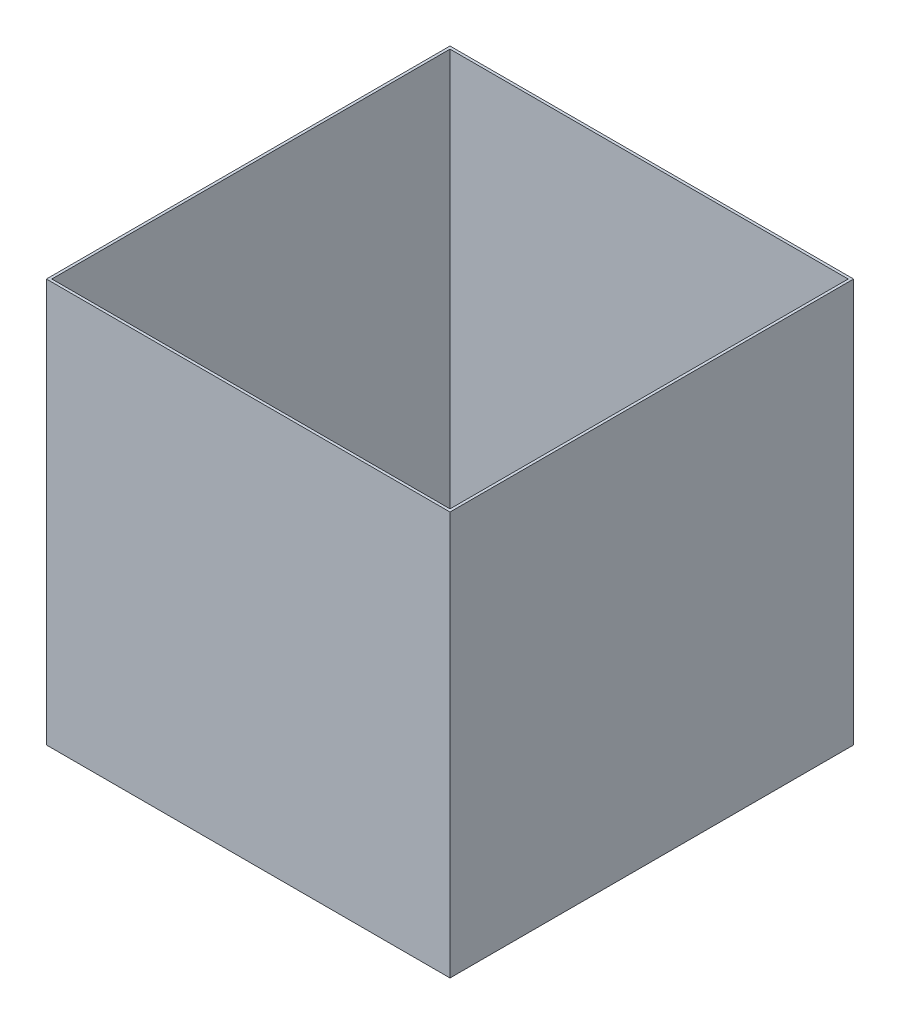
ISO-10303-21;
HEADER;
FILE_DESCRIPTION(('STEP AP214'),'2;1');
FILE_NAME('part.step','',(''),(''),'','','');
FILE_SCHEMA(('AUTOMOTIVE_DESIGN { 1 0 10303 214 1 1 1 1 }'));
ENDSEC;
DATA;
#1=APPLICATION_CONTEXT('core data for automotive mechanical design processes');
#2=APPLICATION_PROTOCOL_DEFINITION('international standard','automotive_design',2000,#1);
#3=PRODUCT_CONTEXT('',#1,'mechanical');
#4=PRODUCT('Part','Part','',(#3));
#5=PRODUCT_RELATED_PRODUCT_CATEGORY('part','',(#4));
#6=PRODUCT_DEFINITION_FORMATION('','',#4);
#7=PRODUCT_DEFINITION_CONTEXT('part definition',#1,'design');
#8=PRODUCT_DEFINITION('design','',#6,#7);
#9=PRODUCT_DEFINITION_SHAPE('','',#8);
#10=(LENGTH_UNIT() NAMED_UNIT(*) SI_UNIT(.MILLI.,.METRE.));
#11=(NAMED_UNIT(*) PLANE_ANGLE_UNIT() SI_UNIT($,.RADIAN.));
#12=(NAMED_UNIT(*) SI_UNIT($,.STERADIAN.) SOLID_ANGLE_UNIT());
#13=UNCERTAINTY_MEASURE_WITH_UNIT(LENGTH_MEASURE(1.E-05),#10,'distance_accuracy_value','');
#14=(GEOMETRIC_REPRESENTATION_CONTEXT(3) GLOBAL_UNCERTAINTY_ASSIGNED_CONTEXT((#13)) GLOBAL_UNIT_ASSIGNED_CONTEXT((#10,
#11,#12)) REPRESENTATION_CONTEXT('',''));
#15=CARTESIAN_POINT('',(0.,0.,0.));
#16=DIRECTION('',(0.,0.,1.));
#17=DIRECTION('',(1.,0.,0.));
#18=AXIS2_PLACEMENT_3D('',#15,#16,#17);
#19=CARTESIAN_POINT('',(150.,300.,-150.));
#20=DIRECTION('',(-1.,0.,0.));
#21=DIRECTION('',(0.,0.,1.));
#22=AXIS2_PLACEMENT_3D('',#19,#20,#21);
#23=PLANE('',#22);
#24=DIRECTION('',(0.,0.,-1.));
#25=VECTOR('',#24,1.);
#26=CARTESIAN_POINT('',(150.,0.,-150.));
#27=LINE('',#26,#25);
#28=CARTESIAN_POINT('',(150.,0.,150.));
#29=VERTEX_POINT('',#28);
#30=CARTESIAN_POINT('',(150.,0.,-150.));
#31=VERTEX_POINT('',#30);
#32=EDGE_CURVE('E147',#29,#31,#27,.T.);
#33=ORIENTED_EDGE('',*,*,#32,.T.);
#34=DIRECTION('',(0.,-1.,0.));
#35=VECTOR('',#34,1.);
#36=CARTESIAN_POINT('',(150.,300.,-150.));
#37=LINE('',#36,#35);
#38=CARTESIAN_POINT('',(150.,300.,-150.));
#39=VERTEX_POINT('',#38);
#40=EDGE_CURVE('E11',#39,#31,#37,.T.);
#41=ORIENTED_EDGE('',*,*,#40,.F.);
#42=DIRECTION('',(0.,0.,-1.));
#43=VECTOR('',#42,1.);
#44=CARTESIAN_POINT('',(150.,300.,-150.));
#45=LINE('',#44,#43);
#46=CARTESIAN_POINT('',(150.,300.,150.));
#47=VERTEX_POINT('',#46);
#48=EDGE_CURVE('E140',#47,#39,#45,.T.);
#49=ORIENTED_EDGE('',*,*,#48,.F.);
#50=DIRECTION('',(0.,-1.,0.));
#51=VECTOR('',#50,1.);
#52=CARTESIAN_POINT('',(150.,300.,150.));
#53=LINE('',#52,#51);
#54=EDGE_CURVE('E146',#47,#29,#53,.T.);
#55=ORIENTED_EDGE('',*,*,#54,.T.);
#56=EDGE_LOOP('',(#33,#41,#49,#55));
#57=FACE_BOUND('',#56,.T.);
#58=ADVANCED_FACE('F33',(#57),#23,.F.);
#59=CARTESIAN_POINT('',(-150.,300.,-150.));
#60=DIRECTION('',(0.,0.,1.));
#61=DIRECTION('',(1.,0.,0.));
#62=AXIS2_PLACEMENT_3D('',#59,#60,#61);
#63=PLANE('',#62);
#64=DIRECTION('',(-1.,0.,0.));
#65=VECTOR('',#64,1.);
#66=CARTESIAN_POINT('',(-150.,0.,-150.));
#67=LINE('',#66,#65);
#68=CARTESIAN_POINT('',(-150.,0.,-150.));
#69=VERTEX_POINT('',#68);
#70=EDGE_CURVE('E150',#31,#69,#67,.T.);
#71=ORIENTED_EDGE('',*,*,#70,.T.);
#72=DIRECTION('',(0.,-1.,0.));
#73=VECTOR('',#72,1.);
#74=CARTESIAN_POINT('',(-150.,300.,-150.));
#75=LINE('',#74,#73);
#76=CARTESIAN_POINT('',(-150.,300.,-150.));
#77=VERTEX_POINT('',#76);
#78=EDGE_CURVE('E40',#77,#69,#75,.T.);
#79=ORIENTED_EDGE('',*,*,#78,.F.);
#80=DIRECTION('',(-1.,0.,0.));
#81=VECTOR('',#80,1.);
#82=CARTESIAN_POINT('',(-150.,300.,-150.));
#83=LINE('',#82,#81);
#84=EDGE_CURVE('E84',#39,#77,#83,.T.);
#85=ORIENTED_EDGE('',*,*,#84,.F.);
#86=ORIENTED_EDGE('',*,*,#40,.T.);
#87=EDGE_LOOP('',(#71,#79,#85,#86));
#88=FACE_BOUND('',#87,.T.);
#89=ADVANCED_FACE('F179',(#88),#63,.F.);
#90=CARTESIAN_POINT('',(-150.,300.,-150.));
#91=DIRECTION('',(1.,0.,0.));
#92=DIRECTION('',(0.,0.,-1.));
#93=AXIS2_PLACEMENT_3D('',#90,#91,#92);
#94=PLANE('',#93);
#95=DIRECTION('',(0.,0.,1.));
#96=VECTOR('',#95,1.);
#97=CARTESIAN_POINT('',(-150.,0.,-150.));
#98=LINE('',#97,#96);
#99=CARTESIAN_POINT('',(-150.,0.,150.));
#100=VERTEX_POINT('',#99);
#101=EDGE_CURVE('E152',#69,#100,#98,.T.);
#102=ORIENTED_EDGE('',*,*,#101,.T.);
#103=DIRECTION('',(0.,-1.,0.));
#104=VECTOR('',#103,1.);
#105=CARTESIAN_POINT('',(-150.,300.,150.));
#106=LINE('',#105,#104);
#107=CARTESIAN_POINT('',(-150.,300.,150.));
#108=VERTEX_POINT('',#107);
#109=EDGE_CURVE('E156',#108,#100,#106,.T.);
#110=ORIENTED_EDGE('',*,*,#109,.F.);
#111=DIRECTION('',(0.,0.,1.));
#112=VECTOR('',#111,1.);
#113=CARTESIAN_POINT('',(-150.,300.,-150.));
#114=LINE('',#113,#112);
#115=EDGE_CURVE('E143',#77,#108,#114,.T.);
#116=ORIENTED_EDGE('',*,*,#115,.F.);
#117=ORIENTED_EDGE('',*,*,#78,.T.);
#118=EDGE_LOOP('',(#102,#110,#116,#117));
#119=FACE_BOUND('',#118,.T.);
#120=ADVANCED_FACE('F161',(#119),#94,.F.);
#121=CARTESIAN_POINT('',(-150.,300.,150.));
#122=DIRECTION('',(0.,0.,-1.));
#123=DIRECTION('',(-1.,0.,0.));
#124=AXIS2_PLACEMENT_3D('',#121,#122,#123);
#125=PLANE('',#124);
#126=DIRECTION('',(1.,0.,0.));
#127=VECTOR('',#126,1.);
#128=CARTESIAN_POINT('',(-150.,0.,150.));
#129=LINE('',#128,#127);
#130=EDGE_CURVE('E77',#100,#29,#129,.T.);
#131=ORIENTED_EDGE('',*,*,#130,.T.);
#132=ORIENTED_EDGE('',*,*,#54,.F.);
#133=DIRECTION('',(1.,0.,0.));
#134=VECTOR('',#133,1.);
#135=CARTESIAN_POINT('',(-150.,300.,150.));
#136=LINE('',#135,#134);
#137=EDGE_CURVE('E56',#108,#47,#136,.T.);
#138=ORIENTED_EDGE('',*,*,#137,.F.);
#139=ORIENTED_EDGE('',*,*,#109,.T.);
#140=EDGE_LOOP('',(#131,#132,#138,#139));
#141=FACE_BOUND('',#140,.T.);
#142=ADVANCED_FACE('F169',(#141),#125,.F.);
#143=CARTESIAN_POINT('',(0.,300.,0.));
#144=DIRECTION('',(0.,1.,0.));
#145=DIRECTION('',(0.,0.,1.));
#146=AXIS2_PLACEMENT_3D('',#143,#144,#145);
#147=PLANE('',#146);
#148=DIRECTION('',(0.,0.,-1.));
#149=VECTOR('',#148,1.);
#150=CARTESIAN_POINT('',(148.,300.,-150.));
#151=LINE('',#150,#149);
#152=CARTESIAN_POINT('',(148.,300.,148.));
#153=VERTEX_POINT('',#152);
#154=CARTESIAN_POINT('',(148.,300.,-148.));
#155=VERTEX_POINT('',#154);
#156=EDGE_CURVE('E129',#153,#155,#151,.T.);
#157=ORIENTED_EDGE('',*,*,#156,.F.);
#158=DIRECTION('',(1.,0.,0.));
#159=VECTOR('',#158,1.);
#160=CARTESIAN_POINT('',(-150.,300.,148.));
#161=LINE('',#160,#159);
#162=CARTESIAN_POINT('',(-148.,300.,148.));
#163=VERTEX_POINT('',#162);
#164=EDGE_CURVE('E138',#163,#153,#161,.T.);
#165=ORIENTED_EDGE('',*,*,#164,.F.);
#166=DIRECTION('',(0.,0.,1.));
#167=VECTOR('',#166,1.);
#168=CARTESIAN_POINT('',(-148.,300.,-150.));
#169=LINE('',#168,#167);
#170=CARTESIAN_POINT('',(-148.,300.,-148.));
#171=VERTEX_POINT('',#170);
#172=EDGE_CURVE('E136',#171,#163,#169,.T.);
#173=ORIENTED_EDGE('',*,*,#172,.F.);
#174=DIRECTION('',(-1.,0.,0.));
#175=VECTOR('',#174,1.);
#176=CARTESIAN_POINT('',(-150.,300.,-148.));
#177=LINE('',#176,#175);
#178=EDGE_CURVE('E121',#155,#171,#177,.T.);
#179=ORIENTED_EDGE('',*,*,#178,.F.);
#180=EDGE_LOOP('',(#157,#165,#173,#179));
#181=FACE_BOUND('',#180,.T.);
#182=ORIENTED_EDGE('',*,*,#48,.T.);
#183=ORIENTED_EDGE('',*,*,#84,.T.);
#184=ORIENTED_EDGE('',*,*,#115,.T.);
#185=ORIENTED_EDGE('',*,*,#137,.T.);
#186=EDGE_LOOP('',(#182,#183,#184,#185));
#187=FACE_BOUND('',#186,.T.);
#188=ADVANCED_FACE('F171',(#181,#187),#147,.T.);
#189=CARTESIAN_POINT('',(0.,0.,0.));
#190=DIRECTION('',(0.,1.,0.));
#191=DIRECTION('',(0.,0.,1.));
#192=AXIS2_PLACEMENT_3D('',#189,#190,#191);
#193=PLANE('',#192);
#194=ORIENTED_EDGE('',*,*,#32,.F.);
#195=ORIENTED_EDGE('',*,*,#130,.F.);
#196=ORIENTED_EDGE('',*,*,#101,.F.);
#197=ORIENTED_EDGE('',*,*,#70,.F.);
#198=EDGE_LOOP('',(#194,#195,#196,#197));
#199=FACE_BOUND('',#198,.T.);
#200=ADVANCED_FACE('F165',(#199),#193,.F.);
#201=CARTESIAN_POINT('',(148.,300.,-150.));
#202=DIRECTION('',(-1.,0.,0.));
#203=DIRECTION('',(0.,0.,1.));
#204=AXIS2_PLACEMENT_3D('',#201,#202,#203);
#205=PLANE('',#204);
#206=DIRECTION('',(0.,0.,-1.));
#207=VECTOR('',#206,1.);
#208=CARTESIAN_POINT('',(148.,2.,-150.));
#209=LINE('',#208,#207);
#210=CARTESIAN_POINT('',(148.,2.,148.));
#211=VERTEX_POINT('',#210);
#212=CARTESIAN_POINT('',(148.,2.,-148.));
#213=VERTEX_POINT('',#212);
#214=EDGE_CURVE('E112',#211,#213,#209,.T.);
#215=ORIENTED_EDGE('',*,*,#214,.F.);
#216=DIRECTION('',(0.,-1.,0.));
#217=VECTOR('',#216,1.);
#218=CARTESIAN_POINT('',(148.,300.,148.));
#219=LINE('',#218,#217);
#220=EDGE_CURVE('E132',#153,#211,#219,.T.);
#221=ORIENTED_EDGE('',*,*,#220,.F.);
#222=ORIENTED_EDGE('',*,*,#156,.T.);
#223=DIRECTION('',(0.,-1.,0.));
#224=VECTOR('',#223,1.);
#225=CARTESIAN_POINT('',(148.,300.,-148.));
#226=LINE('',#225,#224);
#227=EDGE_CURVE('E124',#155,#213,#226,.T.);
#228=ORIENTED_EDGE('',*,*,#227,.T.);
#229=EDGE_LOOP('',(#215,#221,#222,#228));
#230=FACE_BOUND('',#229,.T.);
#231=ADVANCED_FACE('F206',(#230),#205,.T.);
#232=CARTESIAN_POINT('',(-150.,300.,-148.));
#233=DIRECTION('',(0.,0.,1.));
#234=DIRECTION('',(1.,0.,0.));
#235=AXIS2_PLACEMENT_3D('',#232,#233,#234);
#236=PLANE('',#235);
#237=DIRECTION('',(-1.,0.,0.));
#238=VECTOR('',#237,1.);
#239=CARTESIAN_POINT('',(-150.,2.,-148.));
#240=LINE('',#239,#238);
#241=CARTESIAN_POINT('',(-148.,2.,-148.));
#242=VERTEX_POINT('',#241);
#243=EDGE_CURVE('E106',#213,#242,#240,.T.);
#244=ORIENTED_EDGE('',*,*,#243,.F.);
#245=ORIENTED_EDGE('',*,*,#227,.F.);
#246=ORIENTED_EDGE('',*,*,#178,.T.);
#247=DIRECTION('',(0.,-1.,0.));
#248=VECTOR('',#247,1.);
#249=CARTESIAN_POINT('',(-148.,300.,-148.));
#250=LINE('',#249,#248);
#251=EDGE_CURVE('E118',#171,#242,#250,.T.);
#252=ORIENTED_EDGE('',*,*,#251,.T.);
#253=EDGE_LOOP('',(#244,#245,#246,#252));
#254=FACE_BOUND('',#253,.T.);
#255=ADVANCED_FACE('F119',(#254),#236,.T.);
#256=CARTESIAN_POINT('',(-148.,300.,-150.));
#257=DIRECTION('',(1.,0.,0.));
#258=DIRECTION('',(0.,0.,-1.));
#259=AXIS2_PLACEMENT_3D('',#256,#257,#258);
#260=PLANE('',#259);
#261=DIRECTION('',(0.,0.,1.));
#262=VECTOR('',#261,1.);
#263=CARTESIAN_POINT('',(-148.,2.,-150.));
#264=LINE('',#263,#262);
#265=CARTESIAN_POINT('',(-148.,2.,148.));
#266=VERTEX_POINT('',#265);
#267=EDGE_CURVE('E110',#242,#266,#264,.T.);
#268=ORIENTED_EDGE('',*,*,#267,.F.);
#269=ORIENTED_EDGE('',*,*,#251,.F.);
#270=ORIENTED_EDGE('',*,*,#172,.T.);
#271=DIRECTION('',(0.,-1.,0.));
#272=VECTOR('',#271,1.);
#273=CARTESIAN_POINT('',(-148.,300.,148.));
#274=LINE('',#273,#272);
#275=EDGE_CURVE('E47',#163,#266,#274,.T.);
#276=ORIENTED_EDGE('',*,*,#275,.T.);
#277=EDGE_LOOP('',(#268,#269,#270,#276));
#278=FACE_BOUND('',#277,.T.);
#279=ADVANCED_FACE('F126',(#278),#260,.T.);
#280=CARTESIAN_POINT('',(-150.,300.,148.));
#281=DIRECTION('',(0.,0.,-1.));
#282=DIRECTION('',(-1.,0.,0.));
#283=AXIS2_PLACEMENT_3D('',#280,#281,#282);
#284=PLANE('',#283);
#285=DIRECTION('',(1.,0.,0.));
#286=VECTOR('',#285,1.);
#287=CARTESIAN_POINT('',(-150.,2.,148.));
#288=LINE('',#287,#286);
#289=EDGE_CURVE('E127',#266,#211,#288,.T.);
#290=ORIENTED_EDGE('',*,*,#289,.F.);
#291=ORIENTED_EDGE('',*,*,#275,.F.);
#292=ORIENTED_EDGE('',*,*,#164,.T.);
#293=ORIENTED_EDGE('',*,*,#220,.T.);
#294=EDGE_LOOP('',(#290,#291,#292,#293));
#295=FACE_BOUND('',#294,.T.);
#296=ADVANCED_FACE('F236',(#295),#284,.T.);
#297=CARTESIAN_POINT('',(0.,2.,0.));
#298=DIRECTION('',(0.,1.,0.));
#299=DIRECTION('',(0.,0.,1.));
#300=AXIS2_PLACEMENT_3D('',#297,#298,#299);
#301=PLANE('',#300);
#302=ORIENTED_EDGE('',*,*,#214,.T.);
#303=ORIENTED_EDGE('',*,*,#243,.T.);
#304=ORIENTED_EDGE('',*,*,#267,.T.);
#305=ORIENTED_EDGE('',*,*,#289,.T.);
#306=EDGE_LOOP('',(#302,#303,#304,#305));
#307=FACE_BOUND('',#306,.T.);
#308=ADVANCED_FACE('F108',(#307),#301,.T.);
#309=CLOSED_SHELL('',(#58,#89,#120,#142,#188,#200,#231,#255,#279,#296,#308));
#310=MANIFOLD_SOLID_BREP('B2',#309);
#311=ADVANCED_BREP_SHAPE_REPRESENTATION('',(#18,#310),#14);
#312=SHAPE_DEFINITION_REPRESENTATION(#9,#311);
ENDSEC;
END-ISO-10303-21;
